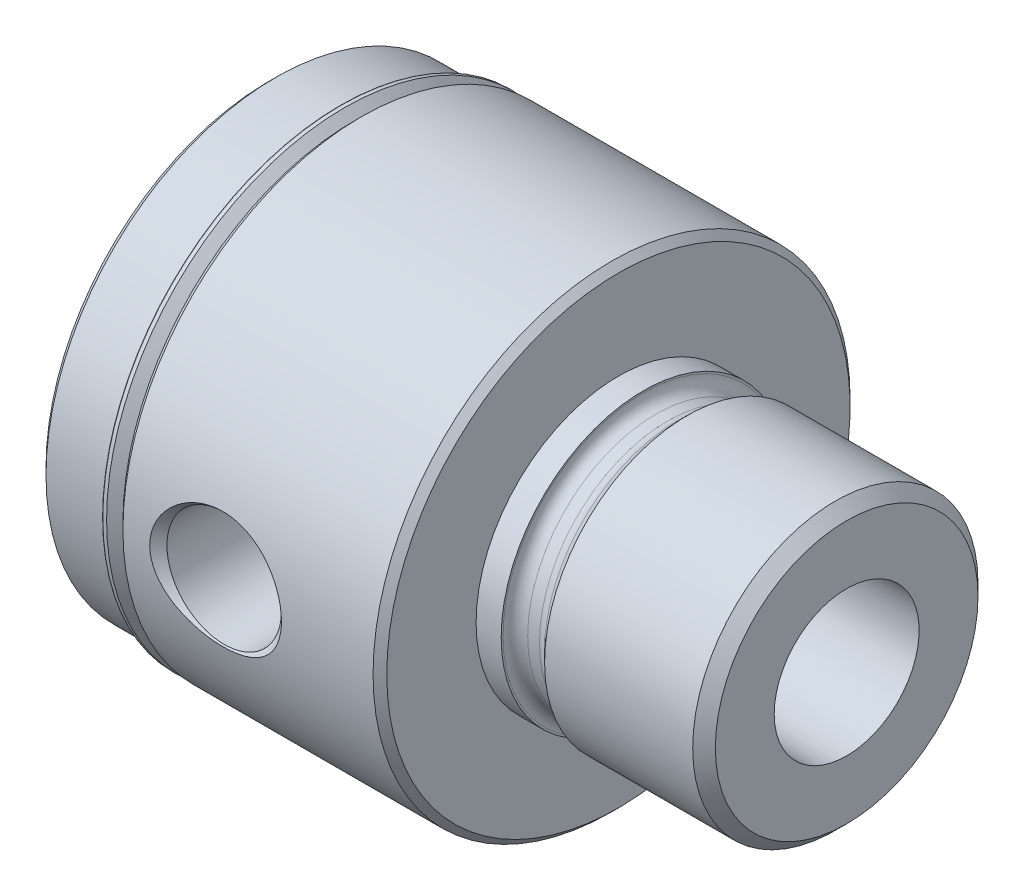
ISO-10303-21;
HEADER;
FILE_DESCRIPTION(('STEP AP214'),'2;1');
FILE_NAME('part.step','',(''),(''),'','','');
FILE_SCHEMA(('AUTOMOTIVE_DESIGN { 1 0 10303 214 1 1 1 1 }'));
ENDSEC;
DATA;
#1=APPLICATION_CONTEXT('core data for automotive mechanical design processes');
#2=APPLICATION_PROTOCOL_DEFINITION('international standard','automotive_design',2000,#1);
#3=PRODUCT_CONTEXT('',#1,'mechanical');
#4=PRODUCT('Part','Part','',(#3));
#5=PRODUCT_RELATED_PRODUCT_CATEGORY('part','',(#4));
#6=PRODUCT_DEFINITION_FORMATION('','',#4);
#7=PRODUCT_DEFINITION_CONTEXT('part definition',#1,'design');
#8=PRODUCT_DEFINITION('design','',#6,#7);
#9=PRODUCT_DEFINITION_SHAPE('','',#8);
#10=(LENGTH_UNIT() NAMED_UNIT(*) SI_UNIT(.MILLI.,.METRE.));
#11=(NAMED_UNIT(*) PLANE_ANGLE_UNIT() SI_UNIT($,.RADIAN.));
#12=(NAMED_UNIT(*) SI_UNIT($,.STERADIAN.) SOLID_ANGLE_UNIT());
#13=UNCERTAINTY_MEASURE_WITH_UNIT(LENGTH_MEASURE(1.E-05),#10,'distance_accuracy_value','');
#14=(GEOMETRIC_REPRESENTATION_CONTEXT(3) GLOBAL_UNCERTAINTY_ASSIGNED_CONTEXT((#13)) GLOBAL_UNIT_ASSIGNED_CONTEXT((#10,
#11,#12)) REPRESENTATION_CONTEXT('',''));
#15=CARTESIAN_POINT('',(0.,0.,0.));
#16=DIRECTION('',(0.,0.,1.));
#17=DIRECTION('',(1.,0.,0.));
#18=AXIS2_PLACEMENT_3D('',#15,#16,#17);
#19=CARTESIAN_POINT('',(25.3999999999999,14.6151600000002,0.));
#20=DIRECTION('',(-1.,0.,0.));
#21=DIRECTION('',(0.,0.,1.));
#22=AXIS2_PLACEMENT_3D('',#19,#20,#21);
#23=PLANE('',#22);
#24=CARTESIAN_POINT('',(25.3999999999997,0.,0.));
#25=DIRECTION('',(-1.,0.,0.));
#26=DIRECTION('',(0.,0.,1.));
#27=AXIS2_PLACEMENT_3D('',#24,#25,#26);
#28=CIRCLE('',#27,14.6151600000002);
#29=CARTESIAN_POINT('',(25.3999999999997,0.,14.6151600000002));
#30=VERTEX_POINT('',#29);
#31=EDGE_CURVE('E125',#30,#30,#28,.T.);
#32=ORIENTED_EDGE('',*,*,#31,.F.);
#33=EDGE_LOOP('',(#32));
#34=FACE_BOUND('',#33,.T.);
#35=CARTESIAN_POINT('',(25.3999999999999,0.,0.));
#36=DIRECTION('',(-1.,0.,0.));
#37=DIRECTION('',(0.,0.,1.));
#38=AXIS2_PLACEMENT_3D('',#35,#36,#37);
#39=CIRCLE('',#38,8.0645);
#40=CARTESIAN_POINT('',(25.3999999999999,0.,8.0645));
#41=VERTEX_POINT('',#40);
#42=EDGE_CURVE('E190',#41,#41,#39,.F.);
#43=ORIENTED_EDGE('',*,*,#42,.F.);
#44=EDGE_LOOP('',(#43));
#45=FACE_BOUND('',#44,.T.);
#46=ADVANCED_FACE('F35',(#34,#45),#23,.F.);
#47=CARTESIAN_POINT('',(-18.288,0.,25.585630358377));
#48=DIRECTION('',(0.,0.,1.));
#49=DIRECTION('',(1.,0.,0.));
#50=AXIS2_PLACEMENT_3D('',#47,#48,#49);
#51=CONICAL_SURFACE('',#50,6.372134104285,0.0312094049979733);
#52=CARTESIAN_POINT('',(-18.288,0.,25.585630358377));
#53=DIRECTION('',(0.,0.,-1.));
#54=DIRECTION('',(-1.,0.,0.));
#55=AXIS2_PLACEMENT_3D('',#52,#53,#54);
#56=CIRCLE('',#55,6.372134104285);
#57=CARTESIAN_POINT('',(-24.660134104285,0.,25.585630358377));
#58=VERTEX_POINT('',#57);
#59=EDGE_CURVE('E162',#58,#58,#56,.T.);
#60=ORIENTED_EDGE('',*,*,#59,.F.);
#61=EDGE_LOOP('',(#60));
#62=FACE_BOUND('',#61,.T.);
#63=CARTESIAN_POINT('',(-21.9422501595857,-4.48171558158441,6.70450488073481));
#64=CARTESIAN_POINT('',(-22.196372008943,-4.27994897936317,6.83936750431233));
#65=CARTESIAN_POINT('',(-22.4336210559118,-4.05680340199298,6.97528438821899));
#66=CARTESIAN_POINT('',(-22.8700643202903,-3.56981026332026,7.23666149597634));
#67=CARTESIAN_POINT('',(-23.0691838561952,-3.30588461860931,7.3621009330154));
#68=CARTESIAN_POINT('',(-23.3954329502363,-2.78342954880212,7.57333072807351));
#69=CARTESIAN_POINT('',(-23.528907814764,-2.53019923947508,7.66225001994694));
#70=CARTESIAN_POINT('',(-23.7007419960291,-2.1333665677312,7.77843088668593));
#71=CARTESIAN_POINT('',(-23.7532871929347,-1.99826970318068,7.81428923884346));
#72=CARTESIAN_POINT('',(-23.848309207216,-1.7230902352386,7.87953506384181));
#73=CARTESIAN_POINT('',(-23.8907905514358,-1.58300990620843,7.90892544563067));
#74=CARTESIAN_POINT('',(-23.96534700624,-1.29771604076106,7.96073303208243));
#75=CARTESIAN_POINT('',(-23.997344191961,-1.15247258219624,7.98309797073675));
#76=CARTESIAN_POINT('',(-24.0499801051286,-0.858948257056047,8.01999008149176));
#77=CARTESIAN_POINT('',(-24.070618745053,-0.710667367085128,8.03451719319874));
#78=CARTESIAN_POINT('',(-24.1001600522482,-0.412409010940775,8.05533490306841));
#79=CARTESIAN_POINT('',(-24.1090662873288,-0.262432074532019,8.06162800517929));
#80=CARTESIAN_POINT('',(-24.1149852464749,0.0378657641243334,8.06580858509963));
#81=CARTESIAN_POINT('',(-24.1119991436807,0.188186630982284,8.06369689201472));
#82=CARTESIAN_POINT('',(-24.0952110184629,0.470694750494254,8.0518485493925));
#83=CARTESIAN_POINT('',(-24.0826792392453,0.602997879113977,8.04300747507597));
#84=CARTESIAN_POINT('',(-24.0485064637167,0.865880396294678,8.01896742261519));
#85=CARTESIAN_POINT('',(-24.026862470281,0.996459203116397,8.00376635259659));
#86=CARTESIAN_POINT('',(-23.97476705113,1.25494476231362,7.96732694724235));
#87=CARTESIAN_POINT('',(-23.9443184063471,1.38285234473417,7.94609051819975));
#88=CARTESIAN_POINT('',(-23.8750011057141,1.63530420042985,7.89800529363593));
#89=CARTESIAN_POINT('',(-23.8361291844322,1.75984714822691,7.87115432167984));
#90=CARTESIAN_POINT('',(-23.7057042825478,2.132601516823,7.78165809233401));
#91=CARTESIAN_POINT('',(-23.6014410983141,2.37455810887627,7.71085315471211));
#92=CARTESIAN_POINT('',(-23.3636935317072,2.83752365200895,7.55279139058956));
#93=CARTESIAN_POINT('',(-23.2302032326687,3.05852834863805,7.46553123343149));
#94=CARTESIAN_POINT('',(-22.9150149557631,3.50997263811297,7.26541141917605));
#95=CARTESIAN_POINT('',(-22.7290560097915,3.73660015128647,7.15067943056018));
#96=CARTESIAN_POINT('',(-22.3268948839036,4.1578157449633,6.91427129086302));
#97=CARTESIAN_POINT('',(-22.1106387865548,4.352345328981,6.79258299388632));
#98=CARTESIAN_POINT('',(-21.7454412804759,4.63436349385094,6.60112484624974));
#99=CARTESIAN_POINT('',(-21.6053586827753,4.73298821109639,6.53057002412192));
#100=CARTESIAN_POINT('',(-21.3159392918616,4.91810782791032,6.39231611808872));
#101=CARTESIAN_POINT('',(-21.1665999794469,5.00459940437839,6.32461782008207));
#102=CARTESIAN_POINT('',(-20.8593083890511,5.16466780430813,6.1945932354079));
#103=CARTESIAN_POINT('',(-20.7013723798135,5.23826798159825,6.1322573408177));
#104=CARTESIAN_POINT('',(-20.3770126442403,5.3719426054678,6.01550262950323));
#105=CARTESIAN_POINT('',(-20.2105904101721,5.43201942008321,5.96108242727694));
#106=CARTESIAN_POINT('',(-19.9249430054809,5.52059004199174,5.87891423285597));
#107=CARTESIAN_POINT('',(-19.8077750040948,5.55302465603974,5.84822019565179));
#108=CARTESIAN_POINT('',(-19.5703429749224,5.61083333618821,5.79278129616531));
#109=CARTESIAN_POINT('',(-19.4500799000395,5.63620954766067,5.76803462651708));
#110=CARTESIAN_POINT('',(-19.2072004213735,5.67952388626195,5.72539035663426));
#111=CARTESIAN_POINT('',(-19.0845877473938,5.69747292118764,5.70748271537881));
#112=CARTESIAN_POINT('',(-18.8376556137315,5.72568317054587,5.67918255245426));
#113=CARTESIAN_POINT('',(-18.7133367972676,5.73594720533166,5.66878727383774));
#114=CARTESIAN_POINT('',(-18.4632867041914,5.74863484981437,5.65592093606921));
#115=CARTESIAN_POINT('',(-18.3375515159012,5.75102072630692,5.65348801388727));
#116=CARTESIAN_POINT('',(-18.0862945586574,5.74779843277445,5.65676392677301));
#117=CARTESIAN_POINT('',(-17.9607727854718,5.74219042315971,5.6624725984664));
#118=CARTESIAN_POINT('',(-17.7108515804586,5.72308386015072,5.68178262632165));
#119=CARTESIAN_POINT('',(-17.5864531063521,5.70957912011648,5.69539017074088));
#120=CARTESIAN_POINT('',(-17.3397135493458,5.67491383242121,5.72993088483851));
#121=CARTESIAN_POINT('',(-17.217373526798,5.6537494582821,5.75086771579382));
#122=CARTESIAN_POINT('',(-16.9533666768235,5.59954837833582,5.80369714146477));
#123=CARTESIAN_POINT('',(-16.8122612737708,5.56504761757921,5.83689364061704));
#124=CARTESIAN_POINT('',(-16.5347540914374,5.48637802937761,5.91089901030021));
#125=CARTESIAN_POINT('',(-16.3983557132373,5.44220237387437,5.95171325403378));
#126=CARTESIAN_POINT('',(-16.1306330131764,5.34469027103046,6.03943298256754));
#127=CARTESIAN_POINT('',(-15.9993177767854,5.2913382716638,6.0863487747768));
#128=CARTESIAN_POINT('',(-15.7423582732087,5.17604397829774,6.18469640633433));
#129=CARTESIAN_POINT('',(-15.6167121805708,5.1141044760005,6.23612677605806));
#130=CARTESIAN_POINT('',(-15.3391320564748,4.96474537761093,6.35601013852087));
#131=CARTESIAN_POINT('',(-15.1889057516377,4.87489655882523,6.42540011132712));
#132=CARTESIAN_POINT('',(-14.8979620476536,4.68269783652749,6.56679101956988));
#133=CARTESIAN_POINT('',(-14.757246862009,4.58034503844461,6.63879255684002));
#134=CARTESIAN_POINT('',(-14.4856227791063,4.36347550226449,6.78330545889964));
#135=CARTESIAN_POINT('',(-14.3547204610628,4.2489507254591,6.85581713070972));
#136=CARTESIAN_POINT('',(-14.1033665136231,4.00811514537004,6.99934451417421));
#137=CARTESIAN_POINT('',(-13.9829139265194,3.88180542437165,7.07036036246669));
#138=CARTESIAN_POINT('',(-13.752621298039,3.6170607937716,7.20940318441205));
#139=CARTESIAN_POINT('',(-13.6428352114736,3.47857037159048,7.27741410059186));
#140=CARTESIAN_POINT('',(-13.4354900442913,3.1903854213332,7.40828198885991));
#141=CARTESIAN_POINT('',(-13.3379322231325,3.04068974169628,7.47113842982953));
#142=CARTESIAN_POINT('',(-13.1564273431087,2.73108243313005,7.58978076832249));
#143=CARTESIAN_POINT('',(-13.0724507936247,2.57119401959209,7.64558192667194));
#144=CARTESIAN_POINT('',(-12.919184162882,2.24189612565094,7.74853397151354));
#145=CARTESIAN_POINT('',(-12.8498875530055,2.07249092024526,7.79568870207685));
#146=CARTESIAN_POINT('',(-12.7445406912567,1.77433826359201,7.86793300171374));
#147=CARTESIAN_POINT('',(-12.7046200279603,1.64754320679563,7.89549942988241));
#148=CARTESIAN_POINT('',(-12.6335207566146,1.39042813520721,7.94480899928316));
#149=CARTESIAN_POINT('',(-12.602340220523,1.26010890480192,7.96655342478173));
#150=CARTESIAN_POINT('',(-12.5491410507229,0.996799745731224,8.00376292632248));
#151=CARTESIAN_POINT('',(-12.5271175962026,0.863811261070616,8.01923130633011));
#152=CARTESIAN_POINT('',(-12.4925219759595,0.596001992973566,8.04357001421153));
#153=CARTESIAN_POINT('',(-12.4799501490726,0.46118114402418,8.05244010553991));
#154=CARTESIAN_POINT('',(-12.4644328647609,0.190416892381912,8.06339251586877));
#155=CARTESIAN_POINT('',(-12.4615082426018,0.0544716949055756,8.06546014342367));
#156=CARTESIAN_POINT('',(-12.4653891659584,-0.217208966336272,8.06271884803365));
#157=CARTESIAN_POINT('',(-12.47219467123,-0.352944430966919,8.0579099535302));
#158=CARTESIAN_POINT('',(-12.4954307273775,-0.623173341664994,8.04152590928348));
#159=CARTESIAN_POINT('',(-12.5118612750088,-0.757666788151087,8.0299507618211));
#160=CARTESIAN_POINT('',(-12.554109992237,-1.02448865681501,8.0002882562193));
#161=CARTESIAN_POINT('',(-12.5799317781881,-1.15681622442089,7.98219838943467));
#162=CARTESIAN_POINT('',(-12.639764373569,-1.41476002975439,7.94047884148105));
#163=CARTESIAN_POINT('',(-12.6735287945203,-1.5404606543692,7.91701631634226));
#164=CARTESIAN_POINT('',(-12.7491867247477,-1.78826986489332,7.86475146006652));
#165=CARTESIAN_POINT('',(-12.7910830361064,-1.91037719587703,7.83594728846065));
#166=CARTESIAN_POINT('',(-12.9282900747729,-2.27033417583391,7.74229092303298));
#167=CARTESIAN_POINT('',(-13.03516283067,-2.50200468621413,7.67016370247278));
#168=CARTESIAN_POINT('',(-13.2892758871211,-2.96974953878362,7.50235288987844));
#169=CARTESIAN_POINT('',(-13.4396817309467,-3.20345397994072,7.40494252895656));
#170=CARTESIAN_POINT('',(-13.7695939144871,-3.64385483809687,7.19844758874757));
#171=CARTESIAN_POINT('',(-13.9491277851719,-3.8505253663187,7.08935199839687));
#172=CARTESIAN_POINT('',(-14.2556445382452,-4.15696975001748,6.91181742988414));
#173=CARTESIAN_POINT('',(-14.3743508855409,-4.26606475978297,6.84486430616523));
#174=CARTESIAN_POINT('',(-14.6203915113959,-4.47394413773863,6.71083137794828));
#175=CARTESIAN_POINT('',(-14.7477239861791,-4.57273065059054,6.64375160276829));
#176=CARTESIAN_POINT('',(-15.0107602936763,-4.75975358398768,6.51107180968746));
#177=CARTESIAN_POINT('',(-15.1464678390692,-4.84798527389675,6.44547246591855));
#178=CARTESIAN_POINT('',(-15.4258612521065,-5.01341456812903,6.31765544824837));
#179=CARTESIAN_POINT('',(-15.5695453016253,-5.09061467271636,6.255437010066));
#180=CARTESIAN_POINT('',(-15.9554810164921,-5.27737097715479,6.09983406521145));
#181=CARTESIAN_POINT('',(-16.2041550241278,-5.37774596044268,6.01072893449566));
#182=CARTESIAN_POINT('',(-16.5903762731684,-5.5031078230053,5.89535522545197));
#183=CARTESIAN_POINT('',(-16.7212569984866,-5.54068384403026,5.8599563874557));
#184=CARTESIAN_POINT('',(-16.9869626642676,-5.60698710837373,5.79654709122958));
#185=CARTESIAN_POINT('',(-17.1217850104745,-5.63572003450786,5.76853188974213));
#186=CARTESIAN_POINT('',(-17.3743806125875,-5.6802891157809,5.72462270769043));
#187=CARTESIAN_POINT('',(-17.4917245517673,-5.69740451812099,5.70754852633508));
#188=CARTESIAN_POINT('',(-17.7279768529647,-5.7245984217418,5.68027347129171));
#189=CARTESIAN_POINT('',(-17.8468844668206,-5.73468017189506,5.67006942433691));
#190=CARTESIAN_POINT('',(-18.0854350088759,-5.7476407967721,5.65693133363145));
#191=CARTESIAN_POINT('',(-18.2050775330434,-5.75052332632843,5.65399360099406));
#192=CARTESIAN_POINT('',(-18.4442734340169,-5.74904474203858,5.65549689374269));
#193=CARTESIAN_POINT('',(-18.5638268084625,-5.74468344277373,5.65993810800599));
#194=CARTESIAN_POINT('',(-18.8016763901597,-5.72881309361417,5.67600112200179));
#195=CARTESIAN_POINT('',(-18.9199749419365,-5.71732139148264,5.68760549392848));
#196=CARTESIAN_POINT('',(-19.1548524987025,-5.68739887115844,5.71752478736541));
#197=CARTESIAN_POINT('',(-19.2714308602345,-5.6689655214801,5.73584215691165));
#198=CARTESIAN_POINT('',(-19.6178772683966,-5.60358535495474,5.7999822130965));
#199=CARTESIAN_POINT('',(-19.8442054018516,-5.54657597377915,5.8549736710655));
#200=CARTESIAN_POINT('',(-20.3711842331879,-5.3807635720162,6.00837947825581));
#201=CARTESIAN_POINT('',(-20.6656717539482,-5.26038379922488,6.11536557140795));
#202=CARTESIAN_POINT('',(-21.0851403479864,-5.04877315236547,6.28923415514428));
#203=CARTESIAN_POINT('',(-21.2212558824108,-4.97306049636259,6.34942359210883));
#204=CARTESIAN_POINT('',(-21.4860819020381,-4.81164316449929,6.47259712689819));
#205=CARTESIAN_POINT('',(-21.6147965978348,-4.72594425587566,6.53557959880414));
#206=CARTESIAN_POINT('',(-21.8083472415235,-4.58565873361476,6.63412534944275));
#207=CARTESIAN_POINT('',(-21.8758742650346,-4.53441643649651,6.66927915219512));
#208=CARTESIAN_POINT('',(-21.9422501595857,-4.48171558158441,6.70450488073481));
#209=B_SPLINE_CURVE_WITH_KNOTS('',3,(#63,#64,#65,#66,#67,#68,#69,#70,#71,#72,#73,#74,#75,#76,
#77,#78,#79,#80,#81,#82,#83,#84,#85,#86,#87,#88,#89,#90,#91,#92,#93,#94,#95,#96,#97,#98,#99,
#100,#101,#102,#103,#104,#105,#106,#107,#108,#109,#110,#111,#112,#113,#114,#115,#116,#117,#118,
#119,#120,#121,#122,#123,#124,#125,#126,#127,#128,#129,#130,#131,#132,#133,#134,#135,#136,#137,
#138,#139,#140,#141,#142,#143,#144,#145,#146,#147,#148,#149,#150,#151,#152,#153,#154,#155,#156,
#157,#158,#159,#160,#161,#162,#163,#164,#165,#166,#167,#168,#169,#170,#171,#172,#173,#174,#175,
#176,#177,#178,#179,#180,#181,#182,#183,#184,#185,#186,#187,#188,#189,#190,#191,#192,#193,#194,
#195,#196,#197,#198,#199,#200,#201,#202,#203,#204,#205,#206,#207,#208),.UNSPECIFIED.,.T.,.F.,(4,
2,2,2,2,2,2,2,2,2,2,2,2,2,2,2,2,2,2,2,2,2,2,2,2,2,2,2,2,2,2,2,2,2,2,2,2,2,2,2,2,2,2,2,2,2,2,2,2,
2,2,2,2,2,2,2,2,2,2,2,2,2,2,2,2,2,2,2,2,2,2,2,4),(0.,1.05392203166613,2.10988765060508,
3.00504198227542,3.45254501700583,3.89984637555721,4.35040068141068,4.80095845892291,
5.25137919072025,5.70175549108362,6.10085075243676,6.50007738404703,6.89917805815653,
7.29843372837126,8.1133995577227,8.92853051954809,9.86952071119059,10.8122072981011,
11.3674927884252,11.9229300681115,12.4773504795213,13.0316737323628,13.407511360459,
13.7832346291372,14.1584041228028,14.5334358637271,14.9102612699756,15.2870791147182,
15.6641925711372,16.0414946805308,16.487860634997,16.9345426333112,17.3819892632905,
17.8292907729143,18.3934487620592,18.9577375976054,19.5224014483525,20.0870134934259,
20.6543471574084,21.2217392063532,21.7878821696904,22.3537728208949,22.7606397036154,
23.1674167621233,23.5739793979292,23.980556608103,24.3880113384785,24.7954643836158,
25.2029172914022,25.6105272665319,26.006857474595,26.4033244931479,27.195684128914,
28.0760683382185,28.957289561484,29.4805593099231,30.0037199751967,30.5271142477217,
31.0503897062621,31.8944842311426,32.3161550166521,32.737554256386,33.0965968552286,
33.4554735008377,33.8141679182621,34.1728715172493,34.5307058193762,34.8886707433777,
35.6053493490013,36.6065349728119,37.1071527602995,37.6074828518545,37.8827642486171),.UNSPECIFIED.);
#210=CARTESIAN_POINT('',(-21.9422501595857,-4.48171558158441,6.70450488073481));
#211=VERTEX_POINT('',#210);
#212=EDGE_CURVE('E193',#211,#211,#209,.T.);
#213=ORIENTED_EDGE('',*,*,#212,.T.);
#214=EDGE_LOOP('',(#213));
#215=FACE_BOUND('',#214,.T.);
#216=ADVANCED_FACE('F70',(#62,#215),#51,.F.);
#217=CARTESIAN_POINT('',(-38.8874,0.,0.));
#218=DIRECTION('',(1.,0.,0.));
#219=DIRECTION('',(0.,0.,-1.));
#220=AXIS2_PLACEMENT_3D('',#217,#218,#219);
#221=PLANE('',#220);
#222=CARTESIAN_POINT('',(-38.8874,0.,0.));
#223=DIRECTION('',(-1.,0.,0.));
#224=DIRECTION('',(0.,0.,1.));
#225=AXIS2_PLACEMENT_3D('',#222,#223,#224);
#226=CIRCLE('',#225,24.8158);
#227=CARTESIAN_POINT('',(-38.8874,0.,24.8158));
#228=VERTEX_POINT('',#227);
#229=EDGE_CURVE('E150',#228,#228,#226,.T.);
#230=ORIENTED_EDGE('',*,*,#229,.T.);
#231=EDGE_LOOP('',(#230));
#232=FACE_BOUND('',#231,.T.);
#233=CARTESIAN_POINT('',(-38.8874,0.,0.));
#234=DIRECTION('',(-1.,0.,0.));
#235=DIRECTION('',(0.,0.,1.));
#236=AXIS2_PLACEMENT_3D('',#233,#234,#235);
#237=CIRCLE('',#236,8.0645);
#238=CARTESIAN_POINT('',(-38.8874,0.,8.0645));
#239=VERTEX_POINT('',#238);
#240=EDGE_CURVE('E199',#239,#239,#237,.T.);
#241=ORIENTED_EDGE('',*,*,#240,.F.);
#242=EDGE_LOOP('',(#241));
#243=FACE_BOUND('',#242,.T.);
#244=ADVANCED_FACE('F37',(#232,#243),#221,.F.);
#245=CARTESIAN_POINT('',(-29.3624,24.511,0.));
#246=DIRECTION('',(1.,0.,0.));
#247=DIRECTION('',(0.,0.,-1.));
#248=AXIS2_PLACEMENT_3D('',#245,#246,#247);
#249=PLANE('',#248);
#250=CARTESIAN_POINT('',(-29.3624,0.,0.));
#251=DIRECTION('',(-1.,0.,0.));
#252=DIRECTION('',(0.,0.,1.));
#253=AXIS2_PLACEMENT_3D('',#250,#251,#252);
#254=CIRCLE('',#253,25.781);
#255=CARTESIAN_POINT('',(-29.3624,0.,25.781));
#256=VERTEX_POINT('',#255);
#257=EDGE_CURVE('E136',#256,#256,#254,.T.);
#258=ORIENTED_EDGE('',*,*,#257,.T.);
#259=EDGE_LOOP('',(#258));
#260=FACE_BOUND('',#259,.T.);
#261=CARTESIAN_POINT('',(-29.3624,0.,0.));
#262=DIRECTION('',(1.,0.,0.));
#263=DIRECTION('',(0.,0.,-1.));
#264=AXIS2_PLACEMENT_3D('',#261,#262,#263);
#265=CIRCLE('',#264,25.383935322151);
#266=CARTESIAN_POINT('',(-29.3624,0.,-25.383935322151));
#267=VERTEX_POINT('',#266);
#268=EDGE_CURVE('E42',#267,#267,#265,.F.);
#269=ORIENTED_EDGE('',*,*,#268,.F.);
#270=EDGE_LOOP('',(#269));
#271=FACE_BOUND('',#270,.T.);
#272=ADVANCED_FACE('F241',(#260,#271),#249,.F.);
#273=CARTESIAN_POINT('',(0.,0.,0.));
#274=DIRECTION('',(-1.,0.,0.));
#275=DIRECTION('',(0.,0.,1.));
#276=AXIS2_PLACEMENT_3D('',#273,#274,#275);
#277=CYLINDRICAL_SURFACE('',#276,26.543);
#278=CARTESIAN_POINT('',(-0.762,0.,0.));
#279=DIRECTION('',(-1.,0.,0.));
#280=DIRECTION('',(0.,0.,1.));
#281=AXIS2_PLACEMENT_3D('',#278,#279,#280);
#282=CIRCLE('',#281,26.543);
#283=CARTESIAN_POINT('',(-0.762,0.,26.543));
#284=VERTEX_POINT('',#283);
#285=EDGE_CURVE('E121',#284,#284,#282,.T.);
#286=ORIENTED_EDGE('',*,*,#285,.T.);
#287=EDGE_LOOP('',(#286));
#288=FACE_BOUND('',#287,.T.);
#289=CARTESIAN_POINT('',(-28.6004,0.,0.));
#290=DIRECTION('',(-1.,0.,0.));
#291=DIRECTION('',(0.,0.,1.));
#292=AXIS2_PLACEMENT_3D('',#289,#290,#291);
#293=CIRCLE('',#292,26.543);
#294=CARTESIAN_POINT('',(-28.6004,0.,26.543));
#295=VERTEX_POINT('',#294);
#296=EDGE_CURVE('E127',#295,#295,#293,.T.);
#297=ORIENTED_EDGE('',*,*,#296,.F.);
#298=EDGE_LOOP('',(#297));
#299=FACE_BOUND('',#298,.T.);
#300=CARTESIAN_POINT('',(-23.2383380595666,-4.79606006972595,26.1061038228147));
#301=CARTESIAN_POINT('',(-23.0760235956255,-4.92860360509776,26.0817539710612));
#302=CARTESIAN_POINT('',(-22.9078660997341,-5.05400855578927,26.0576731030959));
#303=CARTESIAN_POINT('',(-22.5612759884357,-5.29012407797535,26.0107656680022));
#304=CARTESIAN_POINT('',(-22.3828393493931,-5.40082883845888,25.987939598975));
#305=CARTESIAN_POINT('',(-22.0169391586199,-5.60722444536706,25.9441907148895));
#306=CARTESIAN_POINT('',(-21.8294632743127,-5.70289397510874,25.9232706194244));
#307=CARTESIAN_POINT('',(-21.4470445794762,-5.87873047679977,25.8839621870108));
#308=CARTESIAN_POINT('',(-21.2520990658885,-5.95889177203191,25.8655747778469));
#309=CARTESIAN_POINT('',(-20.8554230347269,-6.10366239336771,25.831796365284));
#310=CARTESIAN_POINT('',(-20.6536695502717,-6.16821146787474,25.8164170130783));
#311=CARTESIAN_POINT('',(-20.2454518506335,-6.28113146116921,25.7891762558812));
#312=CARTESIAN_POINT('',(-20.0389875499731,-6.32950208615054,25.7773149147785));
#313=CARTESIAN_POINT('',(-19.6227748306099,-6.40987362938154,25.7574471628509));
#314=CARTESIAN_POINT('',(-19.4130273374081,-6.44187907812852,25.7494396851675));
#315=CARTESIAN_POINT('',(-18.9916221095036,-6.48941231748874,25.7375013663801));
#316=CARTESIAN_POINT('',(-18.7799649345425,-6.50494478773398,25.7335693675241));
#317=CARTESIAN_POINT('',(-18.3467623624246,-6.51980587217351,25.7298085520752));
#318=CARTESIAN_POINT('',(-18.1251896107311,-6.51839557288225,25.7301668428153));
#319=CARTESIAN_POINT('',(-17.682940418492,-6.49757964316707,25.735431231784));
#320=CARTESIAN_POINT('',(-17.4622640076831,-6.47817342053797,25.7403374796756));
#321=CARTESIAN_POINT('',(-17.0233467415618,-6.42144335056615,25.7545485106689));
#322=CARTESIAN_POINT('',(-16.805106103038,-6.38411792118723,25.763853682138));
#323=CARTESIAN_POINT('',(-16.3725623923559,-6.29168887825165,25.7865810200411));
#324=CARTESIAN_POINT('',(-16.1582607425784,-6.2365789709789,25.8000046438636));
#325=CARTESIAN_POINT('',(-15.7345669815162,-6.108599515551,25.8306060848778));
#326=CARTESIAN_POINT('',(-15.5251917369627,-6.03567659611801,25.8477951678452));
#327=CARTESIAN_POINT('',(-15.1135927863576,-5.87245352674332,25.8853647292947));
#328=CARTESIAN_POINT('',(-14.9113719220639,-5.78214656149887,25.9057464588477));
#329=CARTESIAN_POINT('',(-14.3179779858443,-5.48567202943245,25.9707436678962));
#330=CARTESIAN_POINT('',(-13.9396387350161,-5.25382028150253,26.0192445031197));
#331=CARTESIAN_POINT('',(-13.2420134206161,-4.73322676224216,26.1188642132428));
#332=CARTESIAN_POINT('',(-12.9213079711039,-4.44637766242892,26.169862665135));
#333=CARTESIAN_POINT('',(-12.4849330201965,-3.97493408787922,26.2441632739972));
#334=CARTESIAN_POINT('',(-12.3468770943348,-3.81085302595622,26.2685729952456));
#335=CARTESIAN_POINT('',(-12.0873849411535,-3.46988109822201,26.3157812052067));
#336=CARTESIAN_POINT('',(-11.9659380390665,-3.29299857289348,26.3385807242099));
#337=CARTESIAN_POINT('',(-11.7524069325733,-2.94549144210344,26.3795846389763));
#338=CARTESIAN_POINT('',(-11.6586135631294,-2.77594220399039,26.3980203421186));
#339=CARTESIAN_POINT('',(-11.4873338918057,-2.42863619201602,26.4322338665653));
#340=CARTESIAN_POINT('',(-11.4098379044993,-2.25088436993306,26.4480132653749));
#341=CARTESIAN_POINT('',(-11.2723468362194,-1.88862666579608,26.4763463850697));
#342=CARTESIAN_POINT('',(-11.2123387885326,-1.70412590268823,26.488902495087));
#343=CARTESIAN_POINT('',(-11.1107785472465,-1.32990597600798,26.51032435368));
#344=CARTESIAN_POINT('',(-11.069223685853,-1.14018757096908,26.519190635686));
#345=CARTESIAN_POINT('',(-11.0095345594789,-0.782633025505201,26.5319807665985));
#346=CARTESIAN_POINT('',(-10.9890365257969,-0.615205727238013,26.536401757754));
#347=CARTESIAN_POINT('',(-10.9628070269957,-0.279081429787433,26.5420651236606));
#348=CARTESIAN_POINT('',(-10.9570804513905,-0.110384028713075,26.5433064459056));
#349=CARTESIAN_POINT('',(-10.9605014080117,0.226743580172554,26.5425660296895));
#350=CARTESIAN_POINT('',(-10.9696386077784,0.395173892193064,26.5405865301623));
#351=CARTESIAN_POINT('',(-11.0026139256462,0.7305408558769,26.5334764607571));
#352=CARTESIAN_POINT('',(-11.0264574765529,0.897476932409617,26.5283447263866));
#353=CARTESIAN_POINT('',(-11.1158493781241,1.37394447025664,26.5092342850136));
#354=CARTESIAN_POINT('',(-11.1996340357802,1.68009306621228,26.491443793923));
#355=CARTESIAN_POINT('',(-11.4141084228445,2.27453523007438,26.4470517566859));
#356=CARTESIAN_POINT('',(-11.5448048332242,2.56282624792005,26.4204489555695));
#357=CARTESIAN_POINT('',(-11.8554976085431,3.12987834318403,26.3594402887827));
#358=CARTESIAN_POINT('',(-12.0376566320256,3.40741616595892,26.3247073167892));
#359=CARTESIAN_POINT('',(-12.4412603133965,3.93165141268861,26.2515371595317));
#360=CARTESIAN_POINT('',(-12.6627212706441,4.17833596848857,26.2130984404473));
#361=CARTESIAN_POINT('',(-13.166071485202,4.66429430291143,26.1312616303576));
#362=CARTESIAN_POINT('',(-13.4519923561449,4.8993753219857,26.0878063249484));
#363=CARTESIAN_POINT('',(-14.0564425852555,5.32407891815024,26.0044616190017));
#364=CARTESIAN_POINT('',(-14.3749875441318,5.51367960052352,25.9645739417298));
#365=CARTESIAN_POINT('',(-14.889800862108,5.77162588136506,25.9080686964585));
#366=CARTESIAN_POINT('',(-15.0777362615871,5.85648222882308,25.8889694333732));
#367=CARTESIAN_POINT('',(-15.4599375475754,6.01114109251801,25.8534977738861));
#368=CARTESIAN_POINT('',(-15.654201849128,6.08094734491823,25.837124700942));
#369=CARTESIAN_POINT('',(-16.0478918385603,6.20530178111633,25.8075408362477));
#370=CARTESIAN_POINT('',(-16.2473202800479,6.25984163363308,25.7943317717463));
#371=CARTESIAN_POINT('',(-16.6499145202269,6.353416564318,25.7714428625301));
#372=CARTESIAN_POINT('',(-16.8530791579696,6.39245637640282,25.7617619403483));
#373=CARTESIAN_POINT('',(-17.2743258503726,6.45680555719805,25.7457119692187));
#374=CARTESIAN_POINT('',(-17.4925663393888,6.48114050686541,25.7395789252614));
#375=CARTESIAN_POINT('',(-17.9303837540462,6.51213817181078,25.7317539230286));
#376=CARTESIAN_POINT('',(-18.149960737542,6.51880011652202,25.7300621583989));
#377=CARTESIAN_POINT('',(-18.588914059972,6.51442267821391,25.7311708192778));
#378=CARTESIAN_POINT('',(-18.8082904106877,6.50338441162171,25.7339709614629));
#379=CARTESIAN_POINT('',(-19.2454149438655,6.46364744014338,25.743980444533));
#380=CARTESIAN_POINT('',(-19.4631625193756,6.434942454277,25.7511913535553));
#381=CARTESIAN_POINT('',(-19.8982743505627,6.35949140552114,25.769929155027));
#382=CARTESIAN_POINT('',(-20.115596090551,6.31251357153479,25.781511435104));
#383=CARTESIAN_POINT('',(-20.5454417802101,6.20071558536927,25.8086280497645));
#384=CARTESIAN_POINT('',(-20.7579638292167,6.13588849448029,25.8241639210865));
#385=CARTESIAN_POINT('',(-21.1764970621391,5.98867390666947,25.8586996086973));
#386=CARTESIAN_POINT('',(-21.3825097050382,5.90629037727492,25.8776986422164));
#387=CARTESIAN_POINT('',(-21.7865775015763,5.72422950459552,25.9185792479617));
#388=CARTESIAN_POINT('',(-21.984628818026,5.62454394232146,25.9404621889366));
#389=CARTESIAN_POINT('',(-22.3683221937961,5.40981307727629,25.9860855850723));
#390=CARTESIAN_POINT('',(-22.5540994421456,5.29500308406149,26.0097956459597));
#391=CARTESIAN_POINT('',(-22.9145983936324,5.04943218370289,26.0585830017173));
#392=CARTESIAN_POINT('',(-23.0893210643142,4.91867267547106,26.0836601765731));
#393=CARTESIAN_POINT('',(-23.4260636679036,4.64172581872576,26.134365223246));
#394=CARTESIAN_POINT('',(-23.5880815136018,4.49553594445434,26.1599931846717));
#395=CARTESIAN_POINT('',(-23.8975194381459,4.18852801448937,26.210899772997));
#396=CARTESIAN_POINT('',(-24.0449480423741,4.02771860856581,26.2361785963984));
#397=CARTESIAN_POINT('',(-24.3136353237644,3.70413508382413,26.283741222445));
#398=CARTESIAN_POINT('',(-24.4360058694803,3.54229712205544,26.3061105692767));
#399=CARTESIAN_POINT('',(-24.6650258836344,3.2077311318128,26.3489985332523));
#400=CARTESIAN_POINT('',(-24.7716843368867,3.03500940843613,26.3695182054893));
#401=CARTESIAN_POINT('',(-24.9677592325195,2.67991896656599,26.4079674270998));
#402=CARTESIAN_POINT('',(-25.0571886492345,2.49755764011091,26.4258989229285));
#403=CARTESIAN_POINT('',(-25.2174463611792,2.12455712307777,26.4584981250415));
#404=CARTESIAN_POINT('',(-25.2882777976609,1.93391933676443,26.4731663824323));
#405=CARTESIAN_POINT('',(-25.4021234402376,1.57145992055382,26.4969794579132));
#406=CARTESIAN_POINT('',(-25.4475609460369,1.40042749686713,26.5065951768577));
#407=CARTESIAN_POINT('',(-25.522744990549,1.0548093007267,26.5225968617788));
#408=CARTESIAN_POINT('',(-25.5524935908653,0.880223998272583,26.5289832521014));
#409=CARTESIAN_POINT('',(-25.5958179895671,0.52905371342141,26.5383073553013));
#410=CARTESIAN_POINT('',(-25.6094030745411,0.352469938162145,26.5412470484303));
#411=CARTESIAN_POINT('',(-25.6202315913242,-0.00116717967722327,26.5435905453847));
#412=CARTESIAN_POINT('',(-25.6174759878872,-0.178220493918845,26.5429945579566));
#413=CARTESIAN_POINT('',(-25.5867931022419,-0.673514735532778,26.5363581717998));
#414=CARTESIAN_POINT('',(-25.5403994267609,-0.990753734184425,26.5263236393589));
#415=CARTESIAN_POINT('',(-25.3966439518335,-1.61274030517711,26.4957964138563));
#416=CARTESIAN_POINT('',(-25.2992718961953,-1.91748535058765,26.4753016163451));
#417=CARTESIAN_POINT('',(-25.0566252244458,-2.51089380415579,26.4256706725816));
#418=CARTESIAN_POINT('',(-24.910764484603,-2.79930724194233,26.3964292548016));
#419=CARTESIAN_POINT('',(-24.5773946868599,-3.34995335607976,26.3322156175464));
#420=CARTESIAN_POINT('',(-24.3899061672748,-3.61219885100839,26.2972462263627));
#421=CARTESIAN_POINT('',(-24.042713059069,-4.03046704476374,26.2357804429728));
#422=CARTESIAN_POINT('',(-23.8921956160155,-4.19435473438861,26.2099855493256));
#423=CARTESIAN_POINT('',(-23.5760892566278,-4.50685860281434,26.1580608388426));
#424=CARTESIAN_POINT('',(-23.4105004356921,-4.65547487826723,26.1319310241275));
#425=CARTESIAN_POINT('',(-23.2383380595666,-4.79606006972595,26.1061038228147));
#426=B_SPLINE_CURVE_WITH_KNOTS('',3,(#300,#301,#302,#303,#304,#305,#306,#307,#308,#309,#310,
#311,#312,#313,#314,#315,#316,#317,#318,#319,#320,#321,#322,#323,#324,#325,#326,#327,#328,#329,
#330,#331,#332,#333,#334,#335,#336,#337,#338,#339,#340,#341,#342,#343,#344,#345,#346,#347,#348,
#349,#350,#351,#352,#353,#354,#355,#356,#357,#358,#359,#360,#361,#362,#363,#364,#365,#366,#367,
#368,#369,#370,#371,#372,#373,#374,#375,#376,#377,#378,#379,#380,#381,#382,#383,#384,#385,#386,
#387,#388,#389,#390,#391,#392,#393,#394,#395,#396,#397,#398,#399,#400,#401,#402,#403,#404,#405,
#406,#407,#408,#409,#410,#411,#412,#413,#414,#415,#416,#417,#418,#419,#420,#421,#422,#423,#424,
#425),.UNSPECIFIED.,.T.,.F.,(4,2,2,2,2,2,2,2,2,2,2,2,2,2,2,2,2,2,2,2,2,2,2,2,2,2,2,2,2,2,2,2,2,
2,2,2,2,2,2,2,2,2,2,2,2,2,2,2,2,2,2,2,2,2,2,2,2,2,2,2,2,2,4),(0.,0.632674260659274,
1.265597878728,1.89941090314901,2.53345549472744,3.16990932176874,3.80637470639903,
4.44266379790728,5.07877208440608,5.7427196941333,6.40668915365206,7.07071724394408,
7.734980584083,8.4012591399536,9.06779943997091,10.3995324739608,11.6917408616026,
12.3383462229186,12.9845340323093,13.5676264926672,14.1503714395944,14.7326831951349,
15.3149107378963,15.8204570158965,16.3261706137761,16.8315328182355,17.3370818250089,
18.2861441389687,19.2353416679953,20.232639937881,21.2303527795451,22.3440119324191,
23.458206141475,24.0789003506142,24.6994402954799,25.3203182282101,25.9410063904995,
26.5992741588,27.2575706279882,27.915825577268,28.5743146886757,29.2414436831268,
29.9088323839654,30.5760704232524,31.2436262926417,31.9018093606574,32.5599347417155,
33.218168017224,33.8760143469636,34.4875257331472,35.0986860633597,35.7093843444332,
36.3199794103753,36.8509292222989,37.3818092472672,37.9123841128333,38.4429276535784,
39.4002745425167,40.3578141113446,41.3273767616937,42.2964621080109,42.9675261080826,
43.6385858607614),.UNSPECIFIED.);
#427=CARTESIAN_POINT('',(-23.2383380595666,-4.79606006972595,26.1061038228147));
#428=VERTEX_POINT('',#427);
#429=EDGE_CURVE('E46',#428,#428,#426,.T.);
#430=ORIENTED_EDGE('',*,*,#429,.F.);
#431=EDGE_LOOP('',(#430));
#432=FACE_BOUND('',#431,.T.);
#433=ADVANCED_FACE('F58',(#288,#299,#432),#277,.T.);
#434=CARTESIAN_POINT('',(0.,25.781,0.));
#435=DIRECTION('',(-1.,0.,0.));
#436=DIRECTION('',(0.,0.,1.));
#437=AXIS2_PLACEMENT_3D('',#434,#435,#436);
#438=PLANE('',#437);
#439=CARTESIAN_POINT('',(0.,0.,0.));
#440=DIRECTION('',(-1.,0.,0.));
#441=DIRECTION('',(0.,0.,1.));
#442=AXIS2_PLACEMENT_3D('',#439,#440,#441);
#443=CIRCLE('',#442,25.781);
#444=CARTESIAN_POINT('',(0.,0.,25.781));
#445=VERTEX_POINT('',#444);
#446=EDGE_CURVE('E124',#445,#445,#443,.T.);
#447=ORIENTED_EDGE('',*,*,#446,.F.);
#448=EDGE_LOOP('',(#447));
#449=FACE_BOUND('',#448,.T.);
#450=CARTESIAN_POINT('',(0.,0.,0.));
#451=DIRECTION('',(-1.,0.,0.));
#452=DIRECTION('',(0.,0.,1.));
#453=AXIS2_PLACEMENT_3D('',#450,#451,#452);
#454=CIRCLE('',#453,15.84325);
#455=CARTESIAN_POINT('',(0.,0.,15.84325));
#456=VERTEX_POINT('',#455);
#457=EDGE_CURVE('E50',#456,#456,#454,.F.);
#458=ORIENTED_EDGE('',*,*,#457,.F.);
#459=EDGE_LOOP('',(#458));
#460=FACE_BOUND('',#459,.T.);
#461=ADVANCED_FACE('F108',(#449,#460),#438,.F.);
#462=CARTESIAN_POINT('',(-28.6004,0.,0.));
#463=DIRECTION('',(1.,0.,0.));
#464=DIRECTION('',(0.,0.,-1.));
#465=AXIS2_PLACEMENT_3D('',#462,#463,#464);
#466=CONICAL_SURFACE('',#465,26.543,0.785398163397451);
#467=ORIENTED_EDGE('',*,*,#257,.F.);
#468=EDGE_LOOP('',(#467));
#469=FACE_BOUND('',#468,.T.);
#470=ORIENTED_EDGE('',*,*,#296,.T.);
#471=EDGE_LOOP('',(#470));
#472=FACE_BOUND('',#471,.T.);
#473=ADVANCED_FACE('F110',(#469,#472),#466,.T.);
#474=CARTESIAN_POINT('',(0.,0.,0.));
#475=DIRECTION('',(-1.,0.,0.));
#476=DIRECTION('',(0.,0.,1.));
#477=AXIS2_PLACEMENT_3D('',#474,#475,#476);
#478=CONICAL_SURFACE('',#477,25.781,0.78539816339745);
#479=ORIENTED_EDGE('',*,*,#285,.F.);
#480=EDGE_LOOP('',(#479));
#481=FACE_BOUND('',#480,.T.);
#482=ORIENTED_EDGE('',*,*,#446,.T.);
#483=EDGE_LOOP('',(#482));
#484=FACE_BOUND('',#483,.T.);
#485=ADVANCED_FACE('F103',(#481,#484),#478,.T.);
#486=CARTESIAN_POINT('',(25.3999999999997,0.,0.));
#487=DIRECTION('',(-1.,0.,0.));
#488=DIRECTION('',(0.,0.,1.));
#489=AXIS2_PLACEMENT_3D('',#486,#487,#488);
#490=CONICAL_SURFACE('',#489,14.6151600000002,0.785398163397449);
#491=CARTESIAN_POINT('',(24.1401599999997,0.,0.));
#492=DIRECTION('',(-1.,0.,0.));
#493=DIRECTION('',(0.,0.,1.));
#494=AXIS2_PLACEMENT_3D('',#491,#492,#493);
#495=CIRCLE('',#494,15.8750000000003);
#496=CARTESIAN_POINT('',(24.1401599999997,0.,15.8750000000003));
#497=VERTEX_POINT('',#496);
#498=EDGE_CURVE('E130',#497,#497,#495,.T.);
#499=ORIENTED_EDGE('',*,*,#498,.F.);
#500=EDGE_LOOP('',(#499));
#501=FACE_BOUND('',#500,.T.);
#502=ORIENTED_EDGE('',*,*,#31,.T.);
#503=EDGE_LOOP('',(#502));
#504=FACE_BOUND('',#503,.T.);
#505=ADVANCED_FACE('F99',(#501,#504),#490,.T.);
#506=CARTESIAN_POINT('',(25.4,0.,0.));
#507=DIRECTION('',(-1.,0.,0.));
#508=DIRECTION('',(0.,0.,1.));
#509=AXIS2_PLACEMENT_3D('',#506,#507,#508);
#510=CYLINDRICAL_SURFACE('',#509,15.8750000000003);
#511=CARTESIAN_POINT('',(7.65809999999975,0.,0.));
#512=DIRECTION('',(-1.,0.,0.));
#513=DIRECTION('',(0.,0.,1.));
#514=AXIS2_PLACEMENT_3D('',#511,#512,#513);
#515=CIRCLE('',#514,15.8750000000003);
#516=CARTESIAN_POINT('',(7.65809999999975,0.,15.8750000000003));
#517=VERTEX_POINT('',#516);
#518=EDGE_CURVE('E180',#517,#517,#515,.T.);
#519=ORIENTED_EDGE('',*,*,#518,.F.);
#520=EDGE_LOOP('',(#519));
#521=FACE_BOUND('',#520,.T.);
#522=ORIENTED_EDGE('',*,*,#498,.T.);
#523=EDGE_LOOP('',(#522));
#524=FACE_BOUND('',#523,.T.);
#525=ADVANCED_FACE('F95',(#521,#524),#510,.T.);
#526=CARTESIAN_POINT('',(7.65809999999975,0.,0.));
#527=DIRECTION('',(1.,0.,0.));
#528=DIRECTION('',(0.,0.,-1.));
#529=AXIS2_PLACEMENT_3D('',#526,#527,#528);
#530=CONICAL_SURFACE('',#529,15.8750000000003,0.785398163397448);
#531=CARTESIAN_POINT('',(6.44693233892497,0.,0.));
#532=DIRECTION('',(-1.,0.,0.));
#533=DIRECTION('',(0.,0.,1.));
#534=AXIS2_PLACEMENT_3D('',#531,#532,#533);
#535=CIRCLE('',#534,14.6638323389255);
#536=CARTESIAN_POINT('',(6.44693233892497,0.,14.6638323389255));
#537=VERTEX_POINT('',#536);
#538=EDGE_CURVE('E177',#537,#537,#535,.T.);
#539=ORIENTED_EDGE('',*,*,#538,.F.);
#540=EDGE_LOOP('',(#539));
#541=FACE_BOUND('',#540,.T.);
#542=ORIENTED_EDGE('',*,*,#518,.T.);
#543=EDGE_LOOP('',(#542));
#544=FACE_BOUND('',#543,.T.);
#545=ADVANCED_FACE('F91',(#541,#544),#530,.T.);
#546=CARTESIAN_POINT('',(5.47706467784724,0.,0.));
#547=DIRECTION('',(-1.,0.,0.));
#548=DIRECTION('',(0.,0.,1.));
#549=AXIS2_PLACEMENT_3D('',#546,#547,#548);
#550=TOROIDAL_SURFACE('',#549,15.6337000000032,1.37160000000319);
#551=CARTESIAN_POINT('',(5.47706467784724,0.,0.));
#552=DIRECTION('',(-1.,0.,0.));
#553=DIRECTION('',(0.,0.,1.));
#554=AXIS2_PLACEMENT_3D('',#551,#552,#553);
#555=CIRCLE('',#554,14.2621);
#556=CARTESIAN_POINT('',(5.47706467784724,0.,14.2621));
#557=VERTEX_POINT('',#556);
#558=EDGE_CURVE('E174',#557,#557,#555,.T.);
#559=ORIENTED_EDGE('',*,*,#558,.F.);
#560=EDGE_LOOP('',(#559));
#561=FACE_BOUND('',#560,.T.);
#562=ORIENTED_EDGE('',*,*,#538,.T.);
#563=EDGE_LOOP('',(#562));
#564=FACE_BOUND('',#563,.T.);
#565=ADVANCED_FACE('F87',(#561,#564),#550,.F.);
#566=CARTESIAN_POINT('',(25.4,0.,0.));
#567=DIRECTION('',(-1.,0.,0.));
#568=DIRECTION('',(0.,0.,1.));
#569=AXIS2_PLACEMENT_3D('',#566,#567,#568);
#570=CYLINDRICAL_SURFACE('',#569,14.2621);
#571=CARTESIAN_POINT('',(4.16560000000075,0.,0.));
#572=DIRECTION('',(-1.,0.,0.));
#573=DIRECTION('',(0.,0.,1.));
#574=AXIS2_PLACEMENT_3D('',#571,#572,#573);
#575=CIRCLE('',#574,14.2621);
#576=CARTESIAN_POINT('',(4.16560000000075,0.,14.2621));
#577=VERTEX_POINT('',#576);
#578=EDGE_CURVE('E165',#577,#577,#575,.T.);
#579=ORIENTED_EDGE('',*,*,#578,.F.);
#580=EDGE_LOOP('',(#579));
#581=FACE_BOUND('',#580,.T.);
#582=ORIENTED_EDGE('',*,*,#558,.T.);
#583=EDGE_LOOP('',(#582));
#584=FACE_BOUND('',#583,.T.);
#585=ADVANCED_FACE('F83',(#581,#584),#570,.T.);
#586=CARTESIAN_POINT('',(4.16560000000075,0.,0.));
#587=DIRECTION('',(-1.,0.,0.));
#588=DIRECTION('',(0.,0.,1.));
#589=AXIS2_PLACEMENT_3D('',#586,#587,#588);
#590=TOROIDAL_SURFACE('',#589,15.6337000000008,1.37160000000075);
#591=CARTESIAN_POINT('',(2.794,0.,0.));
#592=DIRECTION('',(-1.,0.,0.));
#593=DIRECTION('',(0.,0.,1.));
#594=AXIS2_PLACEMENT_3D('',#591,#592,#593);
#595=CIRCLE('',#594,15.6337000000008);
#596=CARTESIAN_POINT('',(2.794,0.,15.6337000000008));
#597=VERTEX_POINT('',#596);
#598=EDGE_CURVE('E161',#597,#597,#595,.T.);
#599=ORIENTED_EDGE('',*,*,#598,.F.);
#600=EDGE_LOOP('',(#599));
#601=FACE_BOUND('',#600,.T.);
#602=ORIENTED_EDGE('',*,*,#578,.T.);
#603=EDGE_LOOP('',(#602));
#604=FACE_BOUND('',#603,.T.);
#605=ADVANCED_FACE('F79',(#601,#604),#590,.F.);
#606=CARTESIAN_POINT('',(2.794,15.84325,0.));
#607=DIRECTION('',(-1.,0.,0.));
#608=DIRECTION('',(0.,0.,1.));
#609=AXIS2_PLACEMENT_3D('',#606,#607,#608);
#610=PLANE('',#609);
#611=CARTESIAN_POINT('',(2.794,0.,0.));
#612=DIRECTION('',(-1.,0.,0.));
#613=DIRECTION('',(0.,0.,1.));
#614=AXIS2_PLACEMENT_3D('',#611,#612,#613);
#615=CIRCLE('',#614,15.84325);
#616=CARTESIAN_POINT('',(2.794,0.,15.84325));
#617=VERTEX_POINT('',#616);
#618=EDGE_CURVE('E160',#617,#617,#615,.T.);
#619=ORIENTED_EDGE('',*,*,#618,.F.);
#620=EDGE_LOOP('',(#619));
#621=FACE_BOUND('',#620,.T.);
#622=ORIENTED_EDGE('',*,*,#598,.T.);
#623=EDGE_LOOP('',(#622));
#624=FACE_BOUND('',#623,.T.);
#625=ADVANCED_FACE('F75',(#621,#624),#610,.F.);
#626=CARTESIAN_POINT('',(25.4,0.,0.));
#627=DIRECTION('',(-1.,0.,0.));
#628=DIRECTION('',(0.,0.,1.));
#629=AXIS2_PLACEMENT_3D('',#626,#627,#628);
#630=CYLINDRICAL_SURFACE('',#629,15.84325);
#631=ORIENTED_EDGE('',*,*,#457,.T.);
#632=EDGE_LOOP('',(#631));
#633=FACE_BOUND('',#632,.T.);
#634=ORIENTED_EDGE('',*,*,#618,.T.);
#635=EDGE_LOOP('',(#634));
#636=FACE_BOUND('',#635,.T.);
#637=ADVANCED_FACE('F68',(#633,#636),#630,.T.);
#638=CARTESIAN_POINT('',(-18.288,0.,26.543));
#639=DIRECTION('',(0.,0.,1.));
#640=DIRECTION('',(1.,0.,0.));
#641=AXIS2_PLACEMENT_3D('',#638,#639,#640);
#642=CONICAL_SURFACE('',#641,7.329503745908,0.785398163397448);
#643=ORIENTED_EDGE('',*,*,#59,.T.);
#644=EDGE_LOOP('',(#643));
#645=FACE_BOUND('',#644,.T.);
#646=ORIENTED_EDGE('',*,*,#429,.T.);
#647=EDGE_LOOP('',(#646));
#648=FACE_BOUND('',#647,.T.);
#649=ADVANCED_FACE('F62',(#645,#648),#642,.F.);
#650=CARTESIAN_POINT('',(-30.9438010695973,0.,0.));
#651=DIRECTION('',(-1.,0.,0.));
#652=DIRECTION('',(0.,0.,1.));
#653=AXIS2_PLACEMENT_3D('',#650,#651,#652);
#654=CONICAL_SURFACE('',#653,26.3187579510303,0.785398163397448);
#655=CARTESIAN_POINT('',(-30.9438010695973,0.,0.));
#656=DIRECTION('',(-1.,0.,0.));
#657=DIRECTION('',(0.,0.,1.));
#658=AXIS2_PLACEMENT_3D('',#655,#656,#657);
#659=CIRCLE('',#658,26.3187579510303);
#660=CARTESIAN_POINT('',(-30.9438010695973,0.,26.3187579510303));
#661=VERTEX_POINT('',#660);
#662=EDGE_CURVE('E168',#661,#661,#659,.T.);
#663=ORIENTED_EDGE('',*,*,#662,.T.);
#664=EDGE_LOOP('',(#663));
#665=FACE_BOUND('',#664,.T.);
#666=CARTESIAN_POINT('',(-29.3624,0.,0.));
#667=DIRECTION('',(1.,0.,0.));
#668=DIRECTION('',(0.,0.,-1.));
#669=AXIS2_PLACEMENT_3D('',#666,#667,#668);
#670=CIRCLE('',#669,24.737356881433);
#671=CARTESIAN_POINT('',(-29.3624,0.,-24.737356881433));
#672=VERTEX_POINT('',#671);
#673=EDGE_CURVE('E10',#672,#672,#670,.T.);
#674=ORIENTED_EDGE('',*,*,#673,.T.);
#675=EDGE_LOOP('',(#674));
#676=FACE_BOUND('',#675,.T.);
#677=ADVANCED_FACE('F67',(#665,#676),#654,.F.);
#678=CARTESIAN_POINT('',(-28.489464677849,0.,0.));
#679=DIRECTION('',(-1.,0.,0.));
#680=DIRECTION('',(0.,0.,1.));
#681=AXIS2_PLACEMENT_3D('',#678,#679,#680);
#682=CONICAL_SURFACE('',#681,24.511,0.785398163397449);
#683=CARTESIAN_POINT('',(-30.470664677849,0.,0.));
#684=DIRECTION('',(-1.,0.,0.));
#685=DIRECTION('',(0.,0.,1.));
#686=AXIS2_PLACEMENT_3D('',#683,#684,#685);
#687=CIRCLE('',#686,26.4922);
#688=CARTESIAN_POINT('',(-30.470664677849,0.,26.4922));
#689=VERTEX_POINT('',#688);
#690=EDGE_CURVE('E196',#689,#689,#687,.T.);
#691=ORIENTED_EDGE('',*,*,#690,.F.);
#692=EDGE_LOOP('',(#691));
#693=FACE_BOUND('',#692,.T.);
#694=ORIENTED_EDGE('',*,*,#268,.T.);
#695=EDGE_LOOP('',(#694));
#696=FACE_BOUND('',#695,.T.);
#697=ADVANCED_FACE('F215',(#693,#696),#682,.T.);
#698=CARTESIAN_POINT('',(-30.8719590206283,0.,0.));
#699=DIRECTION('',(-1.,0.,0.));
#700=DIRECTION('',(0.,0.,1.));
#701=AXIS2_PLACEMENT_3D('',#698,#699,#700);
#702=TOROIDAL_SURFACE('',#701,26.3905999999993,0.101600000000667);
#703=ORIENTED_EDGE('',*,*,#662,.F.);
#704=EDGE_LOOP('',(#703));
#705=FACE_BOUND('',#704,.T.);
#706=CARTESIAN_POINT('',(-30.8719590206283,0.,0.));
#707=DIRECTION('',(-1.,0.,0.));
#708=DIRECTION('',(0.,0.,1.));
#709=AXIS2_PLACEMENT_3D('',#706,#707,#708);
#710=CIRCLE('',#709,26.4922);
#711=CARTESIAN_POINT('',(-30.8719590206283,0.,26.4922));
#712=VERTEX_POINT('',#711);
#713=EDGE_CURVE('E192',#712,#712,#710,.T.);
#714=ORIENTED_EDGE('',*,*,#713,.T.);
#715=EDGE_LOOP('',(#714));
#716=FACE_BOUND('',#715,.T.);
#717=ADVANCED_FACE('F211',(#705,#716),#702,.T.);
#718=CARTESIAN_POINT('',(-30.470664677849,0.,0.));
#719=DIRECTION('',(-1.,0.,0.));
#720=DIRECTION('',(0.,0.,1.));
#721=AXIS2_PLACEMENT_3D('',#718,#719,#720);
#722=CYLINDRICAL_SURFACE('',#721,26.4922);
#723=ORIENTED_EDGE('',*,*,#713,.F.);
#724=EDGE_LOOP('',(#723));
#725=FACE_BOUND('',#724,.T.);
#726=ORIENTED_EDGE('',*,*,#690,.T.);
#727=EDGE_LOOP('',(#726));
#728=FACE_BOUND('',#727,.T.);
#729=ADVANCED_FACE('F214',(#725,#728),#722,.T.);
#730=CARTESIAN_POINT('',(-38.1254,0.,0.));
#731=DIRECTION('',(1.,0.,0.));
#732=DIRECTION('',(0.,0.,-1.));
#733=AXIS2_PLACEMENT_3D('',#730,#731,#732);
#734=CONICAL_SURFACE('',#733,25.5778,0.785398163397446);
#735=ORIENTED_EDGE('',*,*,#229,.F.);
#736=EDGE_LOOP('',(#735));
#737=FACE_BOUND('',#736,.T.);
#738=CARTESIAN_POINT('',(-38.1254,0.,0.));
#739=DIRECTION('',(-1.,0.,0.));
#740=DIRECTION('',(0.,0.,1.));
#741=AXIS2_PLACEMENT_3D('',#738,#739,#740);
#742=CIRCLE('',#741,25.5778);
#743=CARTESIAN_POINT('',(-38.1254,0.,25.5778));
#744=VERTEX_POINT('',#743);
#745=EDGE_CURVE('E148',#744,#744,#742,.T.);
#746=ORIENTED_EDGE('',*,*,#745,.T.);
#747=EDGE_LOOP('',(#746));
#748=FACE_BOUND('',#747,.T.);
#749=ADVANCED_FACE('F220',(#737,#748),#734,.T.);
#750=CARTESIAN_POINT('',(0.,0.,0.));
#751=DIRECTION('',(-1.,0.,0.));
#752=DIRECTION('',(0.,0.,1.));
#753=AXIS2_PLACEMENT_3D('',#750,#751,#752);
#754=CYLINDRICAL_SURFACE('',#753,25.5778);
#755=ORIENTED_EDGE('',*,*,#745,.F.);
#756=EDGE_LOOP('',(#755));
#757=FACE_BOUND('',#756,.T.);
#758=CARTESIAN_POINT('',(-31.496,0.,0.));
#759=DIRECTION('',(-1.,0.,0.));
#760=DIRECTION('',(0.,0.,1.));
#761=AXIS2_PLACEMENT_3D('',#758,#759,#760);
#762=CIRCLE('',#761,25.5778);
#763=CARTESIAN_POINT('',(-31.496,0.,25.5778));
#764=VERTEX_POINT('',#763);
#765=EDGE_CURVE('E145',#764,#764,#762,.T.);
#766=ORIENTED_EDGE('',*,*,#765,.T.);
#767=EDGE_LOOP('',(#766));
#768=FACE_BOUND('',#767,.T.);
#769=ADVANCED_FACE('F275',(#757,#768),#754,.T.);
#770=CARTESIAN_POINT('',(-30.4292,0.,0.));
#771=DIRECTION('',(-1.,0.,0.));
#772=DIRECTION('',(0.,0.,1.));
#773=AXIS2_PLACEMENT_3D('',#770,#771,#772);
#774=CONICAL_SURFACE('',#773,24.511,0.785398163397453);
#775=ORIENTED_EDGE('',*,*,#765,.F.);
#776=EDGE_LOOP('',(#775));
#777=FACE_BOUND('',#776,.T.);
#778=CARTESIAN_POINT('',(-30.4292,0.,0.));
#779=DIRECTION('',(-1.,0.,0.));
#780=DIRECTION('',(0.,0.,1.));
#781=AXIS2_PLACEMENT_3D('',#778,#779,#780);
#782=CIRCLE('',#781,24.511);
#783=CARTESIAN_POINT('',(-30.4292,0.,24.511));
#784=VERTEX_POINT('',#783);
#785=EDGE_CURVE('E142',#784,#784,#782,.T.);
#786=ORIENTED_EDGE('',*,*,#785,.T.);
#787=EDGE_LOOP('',(#786));
#788=FACE_BOUND('',#787,.T.);
#789=ADVANCED_FACE('F271',(#777,#788),#774,.T.);
#790=CARTESIAN_POINT('',(0.,0.,0.));
#791=DIRECTION('',(-1.,0.,0.));
#792=DIRECTION('',(0.,0.,1.));
#793=AXIS2_PLACEMENT_3D('',#790,#791,#792);
#794=CYLINDRICAL_SURFACE('',#793,24.511);
#795=ORIENTED_EDGE('',*,*,#785,.F.);
#796=EDGE_LOOP('',(#795));
#797=FACE_BOUND('',#796,.T.);
#798=CARTESIAN_POINT('',(-29.3624,0.,0.));
#799=DIRECTION('',(-1.,0.,0.));
#800=DIRECTION('',(0.,0.,1.));
#801=AXIS2_PLACEMENT_3D('',#798,#799,#800);
#802=CIRCLE('',#801,24.511);
#803=CARTESIAN_POINT('',(-29.3624,0.,24.511));
#804=VERTEX_POINT('',#803);
#805=EDGE_CURVE('E139',#804,#804,#802,.T.);
#806=ORIENTED_EDGE('',*,*,#805,.T.);
#807=EDGE_LOOP('',(#806));
#808=FACE_BOUND('',#807,.T.);
#809=ADVANCED_FACE('F238',(#797,#808),#794,.T.);
#810=ORIENTED_EDGE('',*,*,#805,.F.);
#811=EDGE_LOOP('',(#810));
#812=FACE_BOUND('',#811,.T.);
#813=ORIENTED_EDGE('',*,*,#673,.F.);
#814=EDGE_LOOP('',(#813));
#815=FACE_BOUND('',#814,.T.);
#816=ADVANCED_FACE('F233',(#812,#815),#249,.F.);
#817=CARTESIAN_POINT('',(35.052,0.,0.));
#818=DIRECTION('',(-1.,0.,0.));
#819=DIRECTION('',(0.,0.,1.));
#820=AXIS2_PLACEMENT_3D('',#817,#818,#819);
#821=CYLINDRICAL_SURFACE('',#820,8.0645);
#822=ORIENTED_EDGE('',*,*,#240,.T.);
#823=EDGE_LOOP('',(#822));
#824=FACE_BOUND('',#823,.T.);
#825=ORIENTED_EDGE('',*,*,#212,.F.);
#826=EDGE_LOOP('',(#825));
#827=FACE_BOUND('',#826,.T.);
#828=ORIENTED_EDGE('',*,*,#42,.T.);
#829=EDGE_LOOP('',(#828));
#830=FACE_BOUND('',#829,.T.);
#831=ADVANCED_FACE('F230',(#824,#827,#830),#821,.F.);
#832=CLOSED_SHELL('',(#46,#216,#244,#272,#433,#461,#473,#485,#505,#525,#545,#565,#585,#605,#625,
#637,#649,#677,#697,#717,#729,#749,#769,#789,#809,#816,#831));
#833=MANIFOLD_SOLID_BREP('B2',#832);
#834=ADVANCED_BREP_SHAPE_REPRESENTATION('',(#18,#833),#14);
#835=SHAPE_DEFINITION_REPRESENTATION(#9,#834);
ENDSEC;
END-ISO-10303-21;
